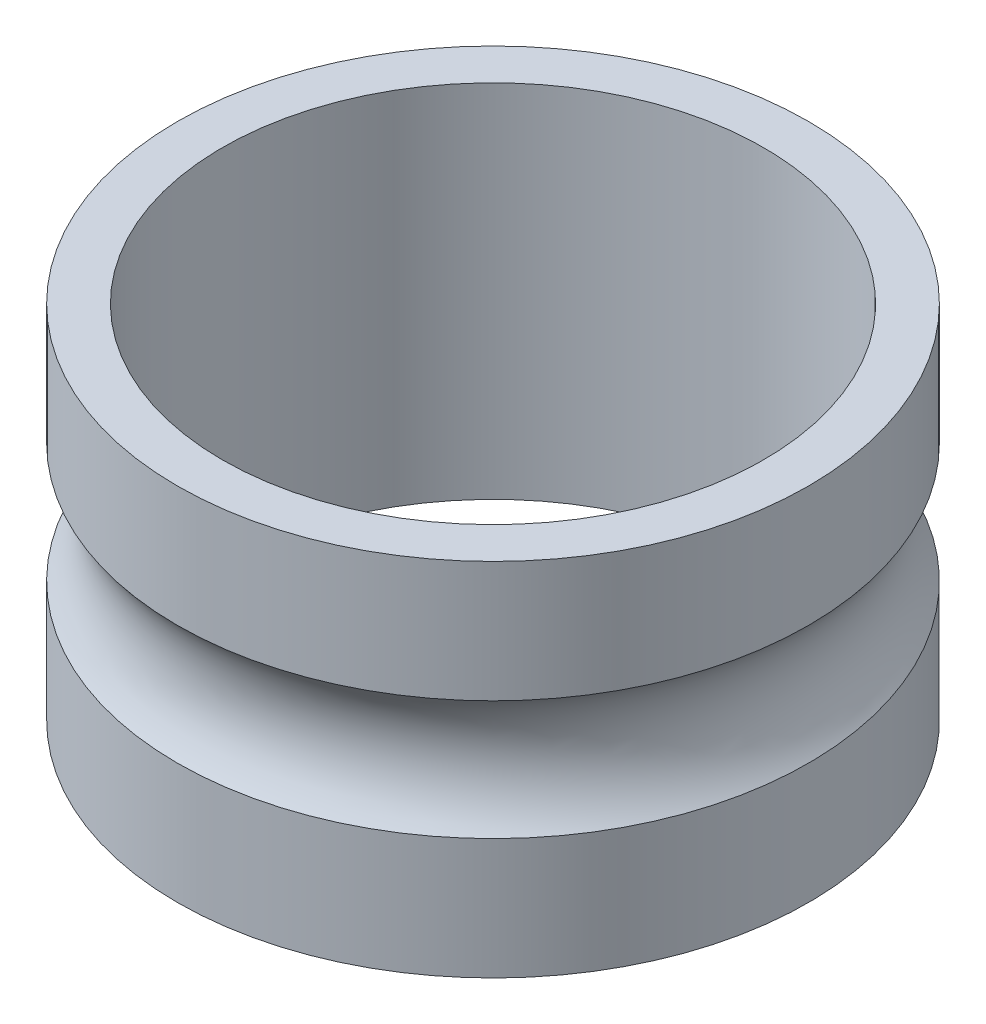
ISO-10303-21;
HEADER;
FILE_DESCRIPTION(('STEP AP214'),'2;1');
FILE_NAME('part.step','',(''),(''),'','','');
FILE_SCHEMA(('AUTOMOTIVE_DESIGN { 1 0 10303 214 1 1 1 1 }'));
ENDSEC;
DATA;
#1=APPLICATION_CONTEXT('core data for automotive mechanical design processes');
#2=APPLICATION_PROTOCOL_DEFINITION('international standard','automotive_design',2000,#1);
#3=PRODUCT_CONTEXT('',#1,'mechanical');
#4=PRODUCT('Part','Part','',(#3));
#5=PRODUCT_RELATED_PRODUCT_CATEGORY('part','',(#4));
#6=PRODUCT_DEFINITION_FORMATION('','',#4);
#7=PRODUCT_DEFINITION_CONTEXT('part definition',#1,'design');
#8=PRODUCT_DEFINITION('design','',#6,#7);
#9=PRODUCT_DEFINITION_SHAPE('','',#8);
#10=(LENGTH_UNIT() NAMED_UNIT(*) SI_UNIT(.MILLI.,.METRE.));
#11=(NAMED_UNIT(*) PLANE_ANGLE_UNIT() SI_UNIT($,.RADIAN.));
#12=(NAMED_UNIT(*) SI_UNIT($,.STERADIAN.) SOLID_ANGLE_UNIT());
#13=UNCERTAINTY_MEASURE_WITH_UNIT(LENGTH_MEASURE(1.E-05),#10,'distance_accuracy_value','');
#14=(GEOMETRIC_REPRESENTATION_CONTEXT(3) GLOBAL_UNCERTAINTY_ASSIGNED_CONTEXT((#13)) GLOBAL_UNIT_ASSIGNED_CONTEXT((#10,
#11,#12)) REPRESENTATION_CONTEXT('',''));
#15=CARTESIAN_POINT('',(0.,0.,0.));
#16=DIRECTION('',(0.,0.,1.));
#17=DIRECTION('',(1.,0.,0.));
#18=AXIS2_PLACEMENT_3D('',#15,#16,#17);
#19=CARTESIAN_POINT('',(0.,1.,0.));
#20=DIRECTION('',(0.,-1.,0.));
#21=DIRECTION('',(0.,0.,-1.));
#22=AXIS2_PLACEMENT_3D('',#19,#20,#21);
#23=CYLINDRICAL_SURFACE('',#22,1.75);
#24=CARTESIAN_POINT('',(0.,1.,0.));
#25=DIRECTION('',(0.,1.,0.));
#26=DIRECTION('',(0.,0.,1.));
#27=AXIS2_PLACEMENT_3D('',#24,#25,#26);
#28=CIRCLE('',#27,1.75);
#29=CARTESIAN_POINT('',(0.,1.,1.75));
#30=VERTEX_POINT('',#29);
#31=EDGE_CURVE('E10',#30,#30,#28,.T.);
#32=ORIENTED_EDGE('',*,*,#31,.F.);
#33=EDGE_LOOP('',(#32));
#34=FACE_BOUND('',#33,.T.);
#35=CARTESIAN_POINT('',(0.,0.330718913883074,0.));
#36=DIRECTION('',(0.,-1.,0.));
#37=DIRECTION('',(0.,0.,-1.));
#38=AXIS2_PLACEMENT_3D('',#35,#36,#37);
#39=CIRCLE('',#38,1.75);
#40=CARTESIAN_POINT('',(0.,0.330718913883074,-1.75));
#41=VERTEX_POINT('',#40);
#42=EDGE_CURVE('E33',#41,#41,#39,.T.);
#43=ORIENTED_EDGE('',*,*,#42,.F.);
#44=EDGE_LOOP('',(#43));
#45=FACE_BOUND('',#44,.T.);
#46=ADVANCED_FACE('F30',(#34,#45),#23,.T.);
#47=CARTESIAN_POINT('',(0.,-1.,0.));
#48=DIRECTION('',(0.,1.,0.));
#49=DIRECTION('',(0.,0.,1.));
#50=AXIS2_PLACEMENT_3D('',#47,#48,#49);
#51=CIRCLE('',#50,1.75);
#52=CARTESIAN_POINT('',(0.,-1.,1.75));
#53=VERTEX_POINT('',#52);
#54=EDGE_CURVE('E37',#53,#53,#51,.T.);
#55=ORIENTED_EDGE('',*,*,#54,.T.);
#56=EDGE_LOOP('',(#55));
#57=FACE_BOUND('',#56,.T.);
#58=CARTESIAN_POINT('',(0.,-0.330718913883074,0.));
#59=DIRECTION('',(0.,1.,0.));
#60=DIRECTION('',(0.,0.,1.));
#61=AXIS2_PLACEMENT_3D('',#58,#59,#60);
#62=CIRCLE('',#61,1.75);
#63=CARTESIAN_POINT('',(0.,-0.330718913883074,1.75));
#64=VERTEX_POINT('',#63);
#65=EDGE_CURVE('E47',#64,#64,#62,.T.);
#66=ORIENTED_EDGE('',*,*,#65,.F.);
#67=EDGE_LOOP('',(#66));
#68=FACE_BOUND('',#67,.T.);
#69=ADVANCED_FACE('F66',(#57,#68),#23,.T.);
#70=CARTESIAN_POINT('',(0.,1.,0.));
#71=DIRECTION('',(0.,1.,0.));
#72=DIRECTION('',(0.,0.,1.));
#73=AXIS2_PLACEMENT_3D('',#70,#71,#72);
#74=PLANE('',#73);
#75=ORIENTED_EDGE('',*,*,#31,.T.);
#76=EDGE_LOOP('',(#75));
#77=FACE_BOUND('',#76,.T.);
#78=CARTESIAN_POINT('',(0.,1.,0.));
#79=DIRECTION('',(0.,1.,0.));
#80=DIRECTION('',(0.,0.,1.));
#81=AXIS2_PLACEMENT_3D('',#78,#79,#80);
#82=CIRCLE('',#81,1.5);
#83=CARTESIAN_POINT('',(0.,1.,1.5));
#84=VERTEX_POINT('',#83);
#85=EDGE_CURVE('E42',#84,#84,#82,.T.);
#86=ORIENTED_EDGE('',*,*,#85,.F.);
#87=EDGE_LOOP('',(#86));
#88=FACE_BOUND('',#87,.T.);
#89=ADVANCED_FACE('F63',(#77,#88),#74,.T.);
#90=CARTESIAN_POINT('',(0.,-1.,0.));
#91=DIRECTION('',(0.,1.,0.));
#92=DIRECTION('',(0.,0.,1.));
#93=AXIS2_PLACEMENT_3D('',#90,#91,#92);
#94=PLANE('',#93);
#95=ORIENTED_EDGE('',*,*,#54,.F.);
#96=EDGE_LOOP('',(#95));
#97=FACE_BOUND('',#96,.T.);
#98=CARTESIAN_POINT('',(0.,-1.,0.));
#99=DIRECTION('',(0.,1.,0.));
#100=DIRECTION('',(0.,0.,1.));
#101=AXIS2_PLACEMENT_3D('',#98,#99,#100);
#102=CIRCLE('',#101,1.5);
#103=CARTESIAN_POINT('',(0.,-1.,1.5));
#104=VERTEX_POINT('',#103);
#105=EDGE_CURVE('E45',#104,#104,#102,.T.);
#106=ORIENTED_EDGE('',*,*,#105,.T.);
#107=EDGE_LOOP('',(#106));
#108=FACE_BOUND('',#107,.T.);
#109=ADVANCED_FACE('F65',(#97,#108),#94,.F.);
#110=CARTESIAN_POINT('',(0.,1.,0.));
#111=DIRECTION('',(0.,-1.,0.));
#112=DIRECTION('',(0.,0.,-1.));
#113=AXIS2_PLACEMENT_3D('',#110,#111,#112);
#114=CYLINDRICAL_SURFACE('',#113,1.5);
#115=ORIENTED_EDGE('',*,*,#85,.T.);
#116=EDGE_LOOP('',(#115));
#117=FACE_BOUND('',#116,.T.);
#118=ORIENTED_EDGE('',*,*,#105,.F.);
#119=EDGE_LOOP('',(#118));
#120=FACE_BOUND('',#119,.T.);
#121=ADVANCED_FACE('F60',(#117,#120),#114,.F.);
#122=CARTESIAN_POINT('',(0.,0.,0.));
#123=DIRECTION('',(0.,1.,0.));
#124=DIRECTION('',(0.,0.,1.));
#125=AXIS2_PLACEMENT_3D('',#122,#123,#124);
#126=TOROIDAL_SURFACE('',#125,2.125,0.5);
#127=ORIENTED_EDGE('',*,*,#65,.T.);
#128=EDGE_LOOP('',(#127));
#129=FACE_BOUND('',#128,.T.);
#130=ORIENTED_EDGE('',*,*,#42,.T.);
#131=EDGE_LOOP('',(#130));
#132=FACE_BOUND('',#131,.T.);
#133=ADVANCED_FACE('F91',(#129,#132),#126,.F.);
#134=CLOSED_SHELL('',(#46,#69,#89,#109,#121,#133));
#135=MANIFOLD_SOLID_BREP('B2',#134);
#136=ADVANCED_BREP_SHAPE_REPRESENTATION('',(#18,#135),#14);
#137=SHAPE_DEFINITION_REPRESENTATION(#9,#136);
ENDSEC;
END-ISO-10303-21;
